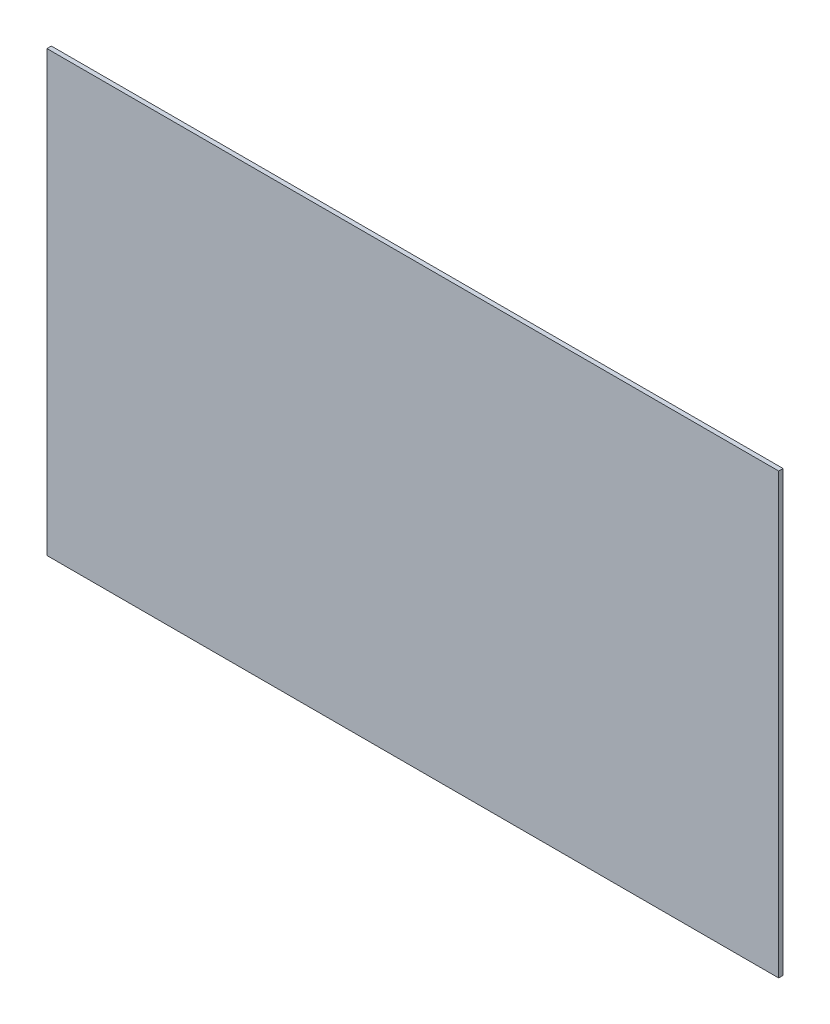
ISO-10303-21;
HEADER;
FILE_DESCRIPTION(('STEP AP214'),'2;1');
FILE_NAME('part.step','',(''),(''),'','','');
FILE_SCHEMA(('AUTOMOTIVE_DESIGN { 1 0 10303 214 1 1 1 1 }'));
ENDSEC;
DATA;
#1=APPLICATION_CONTEXT('core data for automotive mechanical design processes');
#2=APPLICATION_PROTOCOL_DEFINITION('international standard','automotive_design',2000,#1);
#3=PRODUCT_CONTEXT('',#1,'mechanical');
#4=PRODUCT('Part','Part','',(#3));
#5=PRODUCT_RELATED_PRODUCT_CATEGORY('part','',(#4));
#6=PRODUCT_DEFINITION_FORMATION('','',#4);
#7=PRODUCT_DEFINITION_CONTEXT('part definition',#1,'design');
#8=PRODUCT_DEFINITION('design','',#6,#7);
#9=PRODUCT_DEFINITION_SHAPE('','',#8);
#10=(LENGTH_UNIT() NAMED_UNIT(*) SI_UNIT(.MILLI.,.METRE.));
#11=(NAMED_UNIT(*) PLANE_ANGLE_UNIT() SI_UNIT($,.RADIAN.));
#12=(NAMED_UNIT(*) SI_UNIT($,.STERADIAN.) SOLID_ANGLE_UNIT());
#13=UNCERTAINTY_MEASURE_WITH_UNIT(LENGTH_MEASURE(1.E-05),#10,'distance_accuracy_value','');
#14=(GEOMETRIC_REPRESENTATION_CONTEXT(3) GLOBAL_UNCERTAINTY_ASSIGNED_CONTEXT((#13)) GLOBAL_UNIT_ASSIGNED_CONTEXT((#10,
#11,#12)) REPRESENTATION_CONTEXT('',''));
#15=CARTESIAN_POINT('',(0.,0.,0.));
#16=DIRECTION('',(0.,0.,1.));
#17=DIRECTION('',(1.,0.,0.));
#18=AXIS2_PLACEMENT_3D('',#15,#16,#17);
#19=CARTESIAN_POINT('',(0.,0.,3.));
#20=DIRECTION('',(1.,0.,0.));
#21=DIRECTION('',(0.,1.,0.));
#22=AXIS2_PLACEMENT_3D('',#19,#20,#21);
#23=PLANE('',#22);
#24=DIRECTION('',(0.,-1.,0.));
#25=VECTOR('',#24,1.);
#26=CARTESIAN_POINT('',(0.,0.,0.));
#27=LINE('',#26,#25);
#28=CARTESIAN_POINT('',(0.,0.,0.));
#29=VERTEX_POINT('',#28);
#30=CARTESIAN_POINT('',(0.,-300.,0.));
#31=VERTEX_POINT('',#30);
#32=EDGE_CURVE('E107',#29,#31,#27,.T.);
#33=ORIENTED_EDGE('',*,*,#32,.T.);
#34=DIRECTION('',(0.,0.,-1.));
#35=VECTOR('',#34,1.);
#36=CARTESIAN_POINT('',(0.,-300.,3.));
#37=LINE('',#36,#35);
#38=CARTESIAN_POINT('',(0.,-300.,3.));
#39=VERTEX_POINT('',#38);
#40=EDGE_CURVE('E11',#39,#31,#37,.T.);
#41=ORIENTED_EDGE('',*,*,#40,.F.);
#42=DIRECTION('',(0.,-1.,0.));
#43=VECTOR('',#42,1.);
#44=CARTESIAN_POINT('',(0.,0.,3.));
#45=LINE('',#44,#43);
#46=CARTESIAN_POINT('',(0.,0.,3.));
#47=VERTEX_POINT('',#46);
#48=EDGE_CURVE('E89',#47,#39,#45,.T.);
#49=ORIENTED_EDGE('',*,*,#48,.F.);
#50=DIRECTION('',(0.,0.,-1.));
#51=VECTOR('',#50,1.);
#52=CARTESIAN_POINT('',(0.,0.,3.));
#53=LINE('',#52,#51);
#54=EDGE_CURVE('E56',#47,#29,#53,.T.);
#55=ORIENTED_EDGE('',*,*,#54,.T.);
#56=EDGE_LOOP('',(#33,#41,#49,#55));
#57=FACE_BOUND('',#56,.T.);
#58=ADVANCED_FACE('F39',(#57),#23,.F.);
#59=CARTESIAN_POINT('',(0.,-300.,3.));
#60=DIRECTION('',(0.,1.,0.));
#61=DIRECTION('',(0.,0.,1.));
#62=AXIS2_PLACEMENT_3D('',#59,#60,#61);
#63=PLANE('',#62);
#64=DIRECTION('',(1.,0.,0.));
#65=VECTOR('',#64,1.);
#66=CARTESIAN_POINT('',(0.,-300.,0.));
#67=LINE('',#66,#65);
#68=CARTESIAN_POINT('',(500.,-300.,0.));
#69=VERTEX_POINT('',#68);
#70=EDGE_CURVE('E95',#31,#69,#67,.T.);
#71=ORIENTED_EDGE('',*,*,#70,.T.);
#72=DIRECTION('',(0.,0.,-1.));
#73=VECTOR('',#72,1.);
#74=CARTESIAN_POINT('',(500.,-300.,3.));
#75=LINE('',#74,#73);
#76=CARTESIAN_POINT('',(500.,-300.,3.));
#77=VERTEX_POINT('',#76);
#78=EDGE_CURVE('E48',#77,#69,#75,.T.);
#79=ORIENTED_EDGE('',*,*,#78,.F.);
#80=DIRECTION('',(1.,0.,0.));
#81=VECTOR('',#80,1.);
#82=CARTESIAN_POINT('',(0.,-300.,3.));
#83=LINE('',#82,#81);
#84=EDGE_CURVE('E81',#39,#77,#83,.T.);
#85=ORIENTED_EDGE('',*,*,#84,.F.);
#86=ORIENTED_EDGE('',*,*,#40,.T.);
#87=EDGE_LOOP('',(#71,#79,#85,#86));
#88=FACE_BOUND('',#87,.T.);
#89=ADVANCED_FACE('F94',(#88),#63,.F.);
#90=CARTESIAN_POINT('',(500.,0.,3.));
#91=DIRECTION('',(1.,0.,0.));
#92=DIRECTION('',(0.,1.,0.));
#93=AXIS2_PLACEMENT_3D('',#90,#91,#92);
#94=PLANE('',#93);
#95=DIRECTION('',(0.,-1.,0.));
#96=VECTOR('',#95,1.);
#97=CARTESIAN_POINT('',(500.,0.,0.));
#98=LINE('',#97,#96);
#99=CARTESIAN_POINT('',(500.,0.,0.));
#100=VERTEX_POINT('',#99);
#101=EDGE_CURVE('E112',#100,#69,#98,.T.);
#102=ORIENTED_EDGE('',*,*,#101,.F.);
#103=DIRECTION('',(0.,0.,-1.));
#104=VECTOR('',#103,1.);
#105=CARTESIAN_POINT('',(500.,0.,3.));
#106=LINE('',#105,#104);
#107=CARTESIAN_POINT('',(500.,0.,3.));
#108=VERTEX_POINT('',#107);
#109=EDGE_CURVE('E70',#108,#100,#106,.T.);
#110=ORIENTED_EDGE('',*,*,#109,.F.);
#111=DIRECTION('',(0.,-1.,0.));
#112=VECTOR('',#111,1.);
#113=CARTESIAN_POINT('',(500.,0.,3.));
#114=LINE('',#113,#112);
#115=EDGE_CURVE('E88',#108,#77,#114,.T.);
#116=ORIENTED_EDGE('',*,*,#115,.T.);
#117=ORIENTED_EDGE('',*,*,#78,.T.);
#118=EDGE_LOOP('',(#102,#110,#116,#117));
#119=FACE_BOUND('',#118,.T.);
#120=ADVANCED_FACE('F99',(#119),#94,.T.);
#121=CARTESIAN_POINT('',(0.,0.,3.));
#122=DIRECTION('',(0.,1.,0.));
#123=DIRECTION('',(0.,0.,1.));
#124=AXIS2_PLACEMENT_3D('',#121,#122,#123);
#125=PLANE('',#124);
#126=DIRECTION('',(1.,0.,0.));
#127=VECTOR('',#126,1.);
#128=CARTESIAN_POINT('',(0.,0.,0.));
#129=LINE('',#128,#127);
#130=EDGE_CURVE('E115',#29,#100,#129,.T.);
#131=ORIENTED_EDGE('',*,*,#130,.F.);
#132=ORIENTED_EDGE('',*,*,#54,.F.);
#133=DIRECTION('',(1.,0.,0.));
#134=VECTOR('',#133,1.);
#135=CARTESIAN_POINT('',(0.,0.,3.));
#136=LINE('',#135,#134);
#137=EDGE_CURVE('E101',#47,#108,#136,.T.);
#138=ORIENTED_EDGE('',*,*,#137,.T.);
#139=ORIENTED_EDGE('',*,*,#109,.T.);
#140=EDGE_LOOP('',(#131,#132,#138,#139));
#141=FACE_BOUND('',#140,.T.);
#142=ADVANCED_FACE('F125',(#141),#125,.T.);
#143=CARTESIAN_POINT('',(0.,0.,3.));
#144=DIRECTION('',(0.,0.,1.));
#145=DIRECTION('',(1.,0.,0.));
#146=AXIS2_PLACEMENT_3D('',#143,#144,#145);
#147=PLANE('',#146);
#148=ORIENTED_EDGE('',*,*,#48,.T.);
#149=ORIENTED_EDGE('',*,*,#84,.T.);
#150=ORIENTED_EDGE('',*,*,#115,.F.);
#151=ORIENTED_EDGE('',*,*,#137,.F.);
#152=EDGE_LOOP('',(#148,#149,#150,#151));
#153=FACE_BOUND('',#152,.T.);
#154=ADVANCED_FACE('F85',(#153),#147,.T.);
#155=CARTESIAN_POINT('',(0.,0.,0.));
#156=DIRECTION('',(0.,0.,1.));
#157=DIRECTION('',(1.,0.,0.));
#158=AXIS2_PLACEMENT_3D('',#155,#156,#157);
#159=PLANE('',#158);
#160=ORIENTED_EDGE('',*,*,#32,.F.);
#161=ORIENTED_EDGE('',*,*,#130,.T.);
#162=ORIENTED_EDGE('',*,*,#101,.T.);
#163=ORIENTED_EDGE('',*,*,#70,.F.);
#164=EDGE_LOOP('',(#160,#161,#162,#163));
#165=FACE_BOUND('',#164,.T.);
#166=ADVANCED_FACE('F124',(#165),#159,.F.);
#167=CLOSED_SHELL('',(#58,#89,#120,#142,#154,#166));
#168=MANIFOLD_SOLID_BREP('B2',#167);
#169=ADVANCED_BREP_SHAPE_REPRESENTATION('',(#18,#168),#14);
#170=SHAPE_DEFINITION_REPRESENTATION(#9,#169);
ENDSEC;
END-ISO-10303-21;
